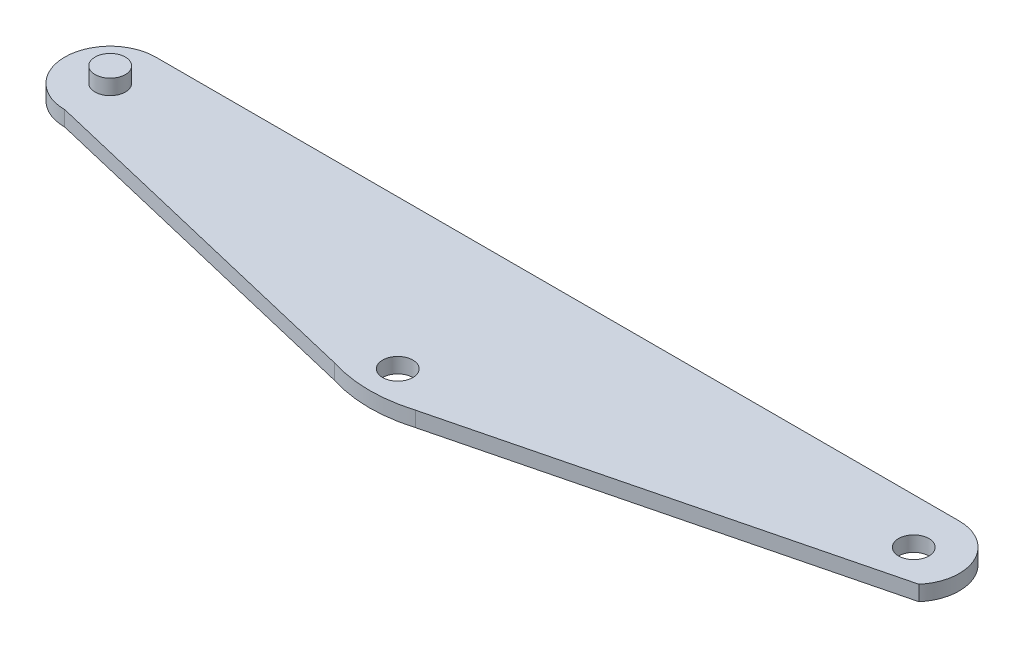
ISO-10303-21;
HEADER;
FILE_DESCRIPTION(('STEP AP214'),'2;1');
FILE_NAME('part.step','',(''),(''),'','','');
FILE_SCHEMA(('AUTOMOTIVE_DESIGN { 1 0 10303 214 1 1 1 1 }'));
ENDSEC;
DATA;
#1=APPLICATION_CONTEXT('core data for automotive mechanical design processes');
#2=APPLICATION_PROTOCOL_DEFINITION('international standard','automotive_design',2000,#1);
#3=PRODUCT_CONTEXT('',#1,'mechanical');
#4=PRODUCT('Part','Part','',(#3));
#5=PRODUCT_RELATED_PRODUCT_CATEGORY('part','',(#4));
#6=PRODUCT_DEFINITION_FORMATION('','',#4);
#7=PRODUCT_DEFINITION_CONTEXT('part definition',#1,'design');
#8=PRODUCT_DEFINITION('design','',#6,#7);
#9=PRODUCT_DEFINITION_SHAPE('','',#8);
#10=(LENGTH_UNIT() NAMED_UNIT(*) SI_UNIT(.MILLI.,.METRE.));
#11=(NAMED_UNIT(*) PLANE_ANGLE_UNIT() SI_UNIT($,.RADIAN.));
#12=(NAMED_UNIT(*) SI_UNIT($,.STERADIAN.) SOLID_ANGLE_UNIT());
#13=UNCERTAINTY_MEASURE_WITH_UNIT(LENGTH_MEASURE(1.E-05),#10,'distance_accuracy_value','');
#14=(GEOMETRIC_REPRESENTATION_CONTEXT(3) GLOBAL_UNCERTAINTY_ASSIGNED_CONTEXT((#13)) GLOBAL_UNIT_ASSIGNED_CONTEXT((#10,
#11,#12)) REPRESENTATION_CONTEXT('',''));
#15=CARTESIAN_POINT('',(0.,0.,0.));
#16=DIRECTION('',(0.,0.,1.));
#17=DIRECTION('',(1.,0.,0.));
#18=AXIS2_PLACEMENT_3D('',#15,#16,#17);
#19=CARTESIAN_POINT('',(2.16188733962354,1.,8.61966954155428));
#20=DIRECTION('',(0.243273736322587,0.,0.969957673929975));
#21=DIRECTION('',(0.969957673929975,0.,-0.243273736322587));
#22=AXIS2_PLACEMENT_3D('',#19,#20,#21);
#23=PLANE('',#22);
#24=DIRECTION('',(-0.969957673929975,0.,0.243273736322587));
#25=VECTOR('',#24,1.);
#26=CARTESIAN_POINT('',(2.16188733962354,0.,8.61966954155428));
#27=LINE('',#26,#25);
#28=CARTESIAN_POINT('',(28.7866674164614,0.,1.94194544889751));
#29=VERTEX_POINT('',#28);
#30=CARTESIAN_POINT('',(2.2478777437235,0.,8.59810240779624));
#31=VERTEX_POINT('',#30);
#32=EDGE_CURVE('E144',#29,#31,#27,.T.);
#33=ORIENTED_EDGE('',*,*,#32,.F.);
#34=DIRECTION('',(0.,-1.,0.));
#35=VECTOR('',#34,1.);
#36=CARTESIAN_POINT('',(28.7866674164614,1.,1.94194544889751));
#37=LINE('',#36,#35);
#38=CARTESIAN_POINT('',(28.7866674164614,1.,1.94194544889751));
#39=VERTEX_POINT('',#38);
#40=EDGE_CURVE('E11',#39,#29,#37,.T.);
#41=ORIENTED_EDGE('',*,*,#40,.F.);
#42=DIRECTION('',(-0.969957673929975,0.,0.243273736322587));
#43=VECTOR('',#42,1.);
#44=CARTESIAN_POINT('',(2.16188733962354,1.,8.61966954155428));
#45=LINE('',#44,#43);
#46=CARTESIAN_POINT('',(2.2478777437235,1.,8.59810240779624));
#47=VERTEX_POINT('',#46);
#48=EDGE_CURVE('E286',#39,#47,#45,.T.);
#49=ORIENTED_EDGE('',*,*,#48,.T.);
#50=DIRECTION('',(0.,-1.,0.));
#51=VECTOR('',#50,1.);
#52=CARTESIAN_POINT('',(2.2478777437235,1.,8.59810240779624));
#53=LINE('',#52,#51);
#54=EDGE_CURVE('E87',#47,#31,#53,.T.);
#55=ORIENTED_EDGE('',*,*,#54,.T.);
#56=EDGE_LOOP('',(#33,#41,#49,#55));
#57=FACE_BOUND('',#56,.T.);
#58=ADVANCED_FACE('F41',(#57),#23,.T.);
#59=CARTESIAN_POINT('',(26.5,1.,0.));
#60=DIRECTION('',(0.,-1.,0.));
#61=DIRECTION('',(0.,0.,-1.));
#62=AXIS2_PLACEMENT_3D('',#59,#60,#61);
#63=CYLINDRICAL_SURFACE('',#62,2.99999999999999);
#64=CARTESIAN_POINT('',(26.5,0.,0.));
#65=DIRECTION('',(0.,1.,0.));
#66=DIRECTION('',(0.,0.,1.));
#67=AXIS2_PLACEMENT_3D('',#64,#65,#66);
#68=CIRCLE('',#67,2.99999999999999);
#69=CARTESIAN_POINT('',(26.5,0.,-3.));
#70=VERTEX_POINT('',#69);
#71=EDGE_CURVE('E141',#29,#70,#68,.T.);
#72=ORIENTED_EDGE('',*,*,#71,.T.);
#73=DIRECTION('',(0.,-1.,0.));
#74=VECTOR('',#73,1.);
#75=CARTESIAN_POINT('',(26.5,1.,-3.));
#76=LINE('',#75,#74);
#77=CARTESIAN_POINT('',(26.5,1.,-3.));
#78=VERTEX_POINT('',#77);
#79=EDGE_CURVE('E51',#78,#70,#76,.T.);
#80=ORIENTED_EDGE('',*,*,#79,.F.);
#81=CARTESIAN_POINT('',(26.5,1.,0.));
#82=DIRECTION('',(0.,1.,0.));
#83=DIRECTION('',(0.,0.,1.));
#84=AXIS2_PLACEMENT_3D('',#81,#82,#83);
#85=CIRCLE('',#84,2.99999999999999);
#86=EDGE_CURVE('E289',#39,#78,#85,.T.);
#87=ORIENTED_EDGE('',*,*,#86,.F.);
#88=ORIENTED_EDGE('',*,*,#40,.T.);
#89=EDGE_LOOP('',(#72,#80,#87,#88));
#90=FACE_BOUND('',#89,.T.);
#91=ADVANCED_FACE('F142',(#90),#63,.T.);
#92=CARTESIAN_POINT('',(0.,1.,-3.));
#93=DIRECTION('',(0.,0.,-1.));
#94=DIRECTION('',(-1.,0.,0.));
#95=AXIS2_PLACEMENT_3D('',#92,#93,#94);
#96=PLANE('',#95);
#97=DIRECTION('',(1.,0.,0.));
#98=VECTOR('',#97,1.);
#99=CARTESIAN_POINT('',(0.,0.,-3.));
#100=LINE('',#99,#98);
#101=CARTESIAN_POINT('',(-26.5,0.,-3.));
#102=VERTEX_POINT('',#101);
#103=EDGE_CURVE('E138',#102,#70,#100,.T.);
#104=ORIENTED_EDGE('',*,*,#103,.F.);
#105=DIRECTION('',(0.,-1.,0.));
#106=VECTOR('',#105,1.);
#107=CARTESIAN_POINT('',(-26.5,1.,-3.));
#108=LINE('',#107,#106);
#109=CARTESIAN_POINT('',(-26.5,1.,-3.));
#110=VERTEX_POINT('',#109);
#111=EDGE_CURVE('E124',#110,#102,#108,.T.);
#112=ORIENTED_EDGE('',*,*,#111,.F.);
#113=DIRECTION('',(1.,0.,0.));
#114=VECTOR('',#113,1.);
#115=CARTESIAN_POINT('',(0.,1.,-3.));
#116=LINE('',#115,#114);
#117=EDGE_CURVE('E116',#110,#78,#116,.T.);
#118=ORIENTED_EDGE('',*,*,#117,.T.);
#119=ORIENTED_EDGE('',*,*,#79,.T.);
#120=EDGE_LOOP('',(#104,#112,#118,#119));
#121=FACE_BOUND('',#120,.T.);
#122=ADVANCED_FACE('F136',(#121),#96,.T.);
#123=CARTESIAN_POINT('',(-26.5,1.,0.));
#124=DIRECTION('',(0.,-1.,0.));
#125=DIRECTION('',(0.,0.,-1.));
#126=AXIS2_PLACEMENT_3D('',#123,#124,#125);
#127=CYLINDRICAL_SURFACE('',#126,3.);
#128=CARTESIAN_POINT('',(-26.5,0.,0.));
#129=DIRECTION('',(0.,1.,0.));
#130=DIRECTION('',(0.,0.,1.));
#131=AXIS2_PLACEMENT_3D('',#128,#129,#130);
#132=CIRCLE('',#131,3.);
#133=CARTESIAN_POINT('',(-26.5,0.,3.));
#134=VERTEX_POINT('',#133);
#135=EDGE_CURVE('E122',#102,#134,#132,.T.);
#136=ORIENTED_EDGE('',*,*,#135,.T.);
#137=DIRECTION('',(0.,-1.,0.));
#138=VECTOR('',#137,1.);
#139=CARTESIAN_POINT('',(-26.5,1.,3.));
#140=LINE('',#139,#138);
#141=CARTESIAN_POINT('',(-26.5,1.,3.));
#142=VERTEX_POINT('',#141);
#143=EDGE_CURVE('E106',#142,#134,#140,.T.);
#144=ORIENTED_EDGE('',*,*,#143,.F.);
#145=CARTESIAN_POINT('',(-26.5,1.,0.));
#146=DIRECTION('',(0.,1.,0.));
#147=DIRECTION('',(0.,0.,1.));
#148=AXIS2_PLACEMENT_3D('',#145,#146,#147);
#149=CIRCLE('',#148,3.);
#150=EDGE_CURVE('E110',#110,#142,#149,.T.);
#151=ORIENTED_EDGE('',*,*,#150,.F.);
#152=ORIENTED_EDGE('',*,*,#111,.T.);
#153=EDGE_LOOP('',(#136,#144,#151,#152));
#154=FACE_BOUND('',#153,.T.);
#155=ADVANCED_FACE('F120',(#154),#127,.T.);
#156=CARTESIAN_POINT('',(-2.10091867350366,1.,8.81508616320892));
#157=DIRECTION('',(0.231838639595406,0.,-0.972754257348973));
#158=DIRECTION('',(-0.972754257348973,0.,-0.231838639595406));
#159=AXIS2_PLACEMENT_3D('',#156,#157,#158);
#160=PLANE('',#159);
#161=DIRECTION('',(0.972754257348973,0.,0.231838639595406));
#162=VECTOR('',#161,1.);
#163=CARTESIAN_POINT('',(-2.10091867350366,0.,8.81508616320892));
#164=LINE('',#163,#162);
#165=CARTESIAN_POINT('',(-3.15389782362465,0.,8.56412735028974));
#166=VERTEX_POINT('',#165);
#167=EDGE_CURVE('E150',#134,#166,#164,.T.);
#168=ORIENTED_EDGE('',*,*,#167,.T.);
#169=DIRECTION('',(0.,-1.,0.));
#170=VECTOR('',#169,1.);
#171=CARTESIAN_POINT('',(-3.15389782362465,1.,8.56412735028974));
#172=LINE('',#171,#170);
#173=CARTESIAN_POINT('',(-3.15389782362465,1.,8.56412735028974));
#174=VERTEX_POINT('',#173);
#175=EDGE_CURVE('E108',#174,#166,#172,.T.);
#176=ORIENTED_EDGE('',*,*,#175,.F.);
#177=DIRECTION('',(0.972754257348973,0.,0.231838639595406));
#178=VECTOR('',#177,1.);
#179=CARTESIAN_POINT('',(-2.10091867350366,1.,8.81508616320892));
#180=LINE('',#179,#178);
#181=EDGE_CURVE('E101',#142,#174,#180,.T.);
#182=ORIENTED_EDGE('',*,*,#181,.F.);
#183=ORIENTED_EDGE('',*,*,#143,.T.);
#184=EDGE_LOOP('',(#168,#176,#182,#183));
#185=FACE_BOUND('',#184,.T.);
#186=ADVANCED_FACE('F104',(#185),#160,.F.);
#187=CARTESIAN_POINT('',(-0.709607330559692,1.,6.82474700501956));
#188=DIRECTION('',(0.,-1.,0.));
#189=DIRECTION('',(0.,0.,-1.));
#190=AXIS2_PLACEMENT_3D('',#187,#188,#189);
#191=CYLINDRICAL_SURFACE('',#190,1.);
#192=CARTESIAN_POINT('',(-0.709607330559692,1.,6.82474700501956));
#193=DIRECTION('',(0.,1.,0.));
#194=DIRECTION('',(0.,0.,1.));
#195=AXIS2_PLACEMENT_3D('',#192,#193,#194);
#196=CIRCLE('',#195,1.);
#197=CARTESIAN_POINT('',(-0.709607330559692,1.,7.82474700501956));
#198=VERTEX_POINT('',#197);
#199=EDGE_CURVE('E191',#198,#198,#196,.T.);
#200=ORIENTED_EDGE('',*,*,#199,.T.);
#201=EDGE_LOOP('',(#200));
#202=FACE_BOUND('',#201,.T.);
#203=CARTESIAN_POINT('',(-0.709607330559692,0.,6.82474700501956));
#204=DIRECTION('',(0.,1.,0.));
#205=DIRECTION('',(0.,0.,1.));
#206=AXIS2_PLACEMENT_3D('',#203,#204,#205);
#207=CIRCLE('',#206,1.);
#208=CARTESIAN_POINT('',(-0.709607330559692,0.,7.82474700501956));
#209=VERTEX_POINT('',#208);
#210=EDGE_CURVE('E166',#209,#209,#207,.T.);
#211=ORIENTED_EDGE('',*,*,#210,.F.);
#212=EDGE_LOOP('',(#211));
#213=FACE_BOUND('',#212,.T.);
#214=ADVANCED_FACE('F178',(#202,#213),#191,.F.);
#215=CARTESIAN_POINT('',(26.5,1.,0.));
#216=DIRECTION('',(0.,-1.,0.));
#217=DIRECTION('',(0.,0.,-1.));
#218=AXIS2_PLACEMENT_3D('',#215,#216,#217);
#219=CYLINDRICAL_SURFACE('',#218,1.);
#220=CARTESIAN_POINT('',(26.5,1.,0.));
#221=DIRECTION('',(0.,1.,0.));
#222=DIRECTION('',(0.,0.,1.));
#223=AXIS2_PLACEMENT_3D('',#220,#221,#222);
#224=CIRCLE('',#223,1.);
#225=CARTESIAN_POINT('',(26.5,1.,0.999999999999992));
#226=VERTEX_POINT('',#225);
#227=EDGE_CURVE('E157',#226,#226,#224,.T.);
#228=ORIENTED_EDGE('',*,*,#227,.T.);
#229=EDGE_LOOP('',(#228));
#230=FACE_BOUND('',#229,.T.);
#231=CARTESIAN_POINT('',(26.5,0.,0.));
#232=DIRECTION('',(0.,1.,0.));
#233=DIRECTION('',(0.,0.,1.));
#234=AXIS2_PLACEMENT_3D('',#231,#232,#233);
#235=CIRCLE('',#234,1.);
#236=CARTESIAN_POINT('',(26.5,0.,0.999999999999992));
#237=VERTEX_POINT('',#236);
#238=EDGE_CURVE('E162',#237,#237,#235,.T.);
#239=ORIENTED_EDGE('',*,*,#238,.F.);
#240=EDGE_LOOP('',(#239));
#241=FACE_BOUND('',#240,.T.);
#242=ADVANCED_FACE('F43',(#230,#241),#219,.F.);
#243=CARTESIAN_POINT('',(-0.398350924905689,1.,-0.10926841540515));
#244=DIRECTION('',(0.,-1.,0.));
#245=DIRECTION('',(0.,0.,-1.));
#246=AXIS2_PLACEMENT_3D('',#243,#244,#245);
#247=CYLINDRICAL_SURFACE('',#246,9.10059519039353);
#248=CARTESIAN_POINT('',(-0.398350924905689,0.,-0.10926841540515));
#249=DIRECTION('',(0.,1.,0.));
#250=DIRECTION('',(0.,0.,1.));
#251=AXIS2_PLACEMENT_3D('',#248,#249,#250);
#252=CIRCLE('',#251,9.10059519039353);
#253=EDGE_CURVE('E80',#166,#31,#252,.T.);
#254=ORIENTED_EDGE('',*,*,#253,.T.);
#255=ORIENTED_EDGE('',*,*,#54,.F.);
#256=CARTESIAN_POINT('',(-0.398350924905689,1.,-0.10926841540515));
#257=DIRECTION('',(0.,1.,0.));
#258=DIRECTION('',(0.,0.,1.));
#259=AXIS2_PLACEMENT_3D('',#256,#257,#258);
#260=CIRCLE('',#259,9.10059519039353);
#261=EDGE_CURVE('E59',#174,#47,#260,.T.);
#262=ORIENTED_EDGE('',*,*,#261,.F.);
#263=ORIENTED_EDGE('',*,*,#175,.T.);
#264=EDGE_LOOP('',(#254,#255,#262,#263));
#265=FACE_BOUND('',#264,.T.);
#266=ADVANCED_FACE('F185',(#265),#247,.T.);
#267=CARTESIAN_POINT('',(0.,1.,0.));
#268=DIRECTION('',(0.,1.,0.));
#269=DIRECTION('',(0.,0.,1.));
#270=AXIS2_PLACEMENT_3D('',#267,#268,#269);
#271=PLANE('',#270);
#272=CARTESIAN_POINT('',(-26.5,1.,0.));
#273=DIRECTION('',(0.,1.,0.));
#274=DIRECTION('',(0.,0.,1.));
#275=AXIS2_PLACEMENT_3D('',#272,#273,#274);
#276=CIRCLE('',#275,1.);
#277=CARTESIAN_POINT('',(-26.5,1.,1.));
#278=VERTEX_POINT('',#277);
#279=EDGE_CURVE('E275',#278,#278,#276,.T.);
#280=ORIENTED_EDGE('',*,*,#279,.F.);
#281=EDGE_LOOP('',(#280));
#282=FACE_BOUND('',#281,.T.);
#283=ORIENTED_EDGE('',*,*,#227,.F.);
#284=EDGE_LOOP('',(#283));
#285=FACE_BOUND('',#284,.T.);
#286=ORIENTED_EDGE('',*,*,#199,.F.);
#287=EDGE_LOOP('',(#286));
#288=FACE_BOUND('',#287,.T.);
#289=ORIENTED_EDGE('',*,*,#48,.F.);
#290=ORIENTED_EDGE('',*,*,#86,.T.);
#291=ORIENTED_EDGE('',*,*,#117,.F.);
#292=ORIENTED_EDGE('',*,*,#150,.T.);
#293=ORIENTED_EDGE('',*,*,#181,.T.);
#294=ORIENTED_EDGE('',*,*,#261,.T.);
#295=EDGE_LOOP('',(#289,#290,#291,#292,#293,#294));
#296=FACE_BOUND('',#295,.T.);
#297=ADVANCED_FACE('F114',(#282,#285,#288,#296),#271,.T.);
#298=CARTESIAN_POINT('',(0.,0.,0.));
#299=DIRECTION('',(0.,1.,0.));
#300=DIRECTION('',(0.,0.,1.));
#301=AXIS2_PLACEMENT_3D('',#298,#299,#300);
#302=PLANE('',#301);
#303=ORIENTED_EDGE('',*,*,#238,.T.);
#304=EDGE_LOOP('',(#303));
#305=FACE_BOUND('',#304,.T.);
#306=ORIENTED_EDGE('',*,*,#210,.T.);
#307=EDGE_LOOP('',(#306));
#308=FACE_BOUND('',#307,.T.);
#309=ORIENTED_EDGE('',*,*,#32,.T.);
#310=ORIENTED_EDGE('',*,*,#253,.F.);
#311=ORIENTED_EDGE('',*,*,#167,.F.);
#312=ORIENTED_EDGE('',*,*,#135,.F.);
#313=ORIENTED_EDGE('',*,*,#103,.T.);
#314=ORIENTED_EDGE('',*,*,#71,.F.);
#315=EDGE_LOOP('',(#309,#310,#311,#312,#313,#314));
#316=FACE_BOUND('',#315,.T.);
#317=ADVANCED_FACE('F146',(#305,#308,#316),#302,.F.);
#318=CARTESIAN_POINT('',(-26.5,2.,0.));
#319=DIRECTION('',(0.,-1.,0.));
#320=DIRECTION('',(0.,0.,-1.));
#321=AXIS2_PLACEMENT_3D('',#318,#319,#320);
#322=CYLINDRICAL_SURFACE('',#321,1.);
#323=CARTESIAN_POINT('',(-26.5,2.,0.));
#324=DIRECTION('',(0.,1.,0.));
#325=DIRECTION('',(0.,0.,1.));
#326=AXIS2_PLACEMENT_3D('',#323,#324,#325);
#327=CIRCLE('',#326,1.);
#328=CARTESIAN_POINT('',(-26.5,2.,1.));
#329=VERTEX_POINT('',#328);
#330=EDGE_CURVE('E167',#329,#329,#327,.T.);
#331=ORIENTED_EDGE('',*,*,#330,.F.);
#332=EDGE_LOOP('',(#331));
#333=FACE_BOUND('',#332,.T.);
#334=ORIENTED_EDGE('',*,*,#279,.T.);
#335=EDGE_LOOP('',(#334));
#336=FACE_BOUND('',#335,.T.);
#337=ADVANCED_FACE('F195',(#333,#336),#322,.T.);
#338=CARTESIAN_POINT('',(-26.5,2.,0.));
#339=DIRECTION('',(0.,1.,0.));
#340=DIRECTION('',(0.,0.,1.));
#341=AXIS2_PLACEMENT_3D('',#338,#339,#340);
#342=PLANE('',#341);
#343=ORIENTED_EDGE('',*,*,#330,.T.);
#344=EDGE_LOOP('',(#343));
#345=FACE_BOUND('',#344,.T.);
#346=ADVANCED_FACE('F202',(#345),#342,.T.);
#347=CLOSED_SHELL('',(#58,#91,#122,#155,#186,#214,#242,#266,#297,#317,#337,#346));
#348=MANIFOLD_SOLID_BREP('B2',#347);
#349=ADVANCED_BREP_SHAPE_REPRESENTATION('',(#18,#348),#14);
#350=SHAPE_DEFINITION_REPRESENTATION(#9,#349);
ENDSEC;
END-ISO-10303-21;
